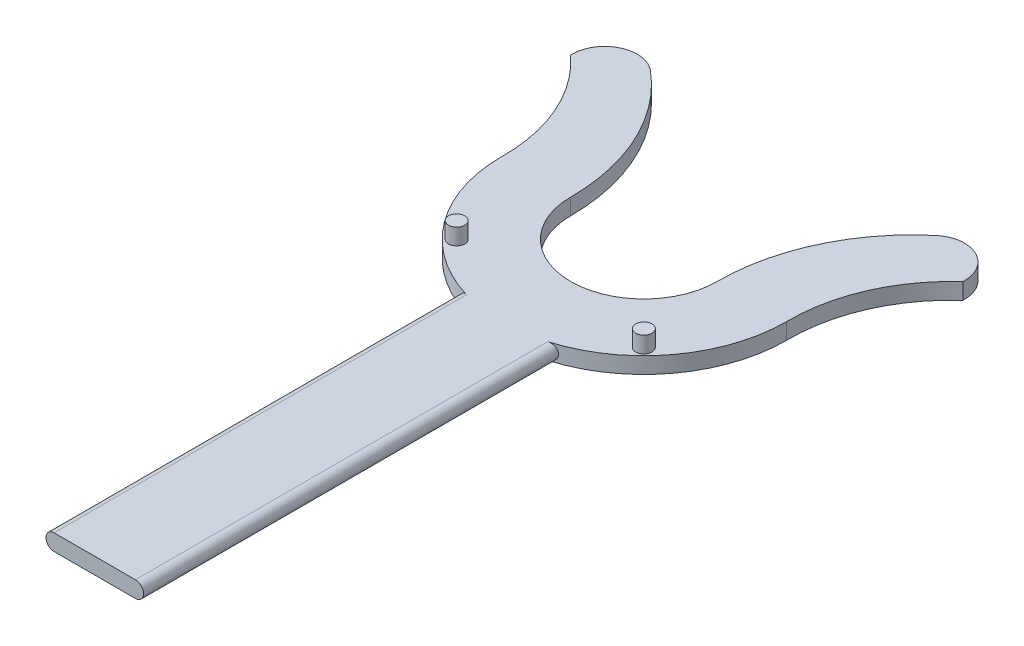
ISO-10303-21;
HEADER;
FILE_DESCRIPTION(('STEP AP214'),'2;1');
FILE_NAME('part.step','',(''),(''),'','','');
FILE_SCHEMA(('AUTOMOTIVE_DESIGN { 1 0 10303 214 1 1 1 1 }'));
ENDSEC;
DATA;
#1=APPLICATION_CONTEXT('core data for automotive mechanical design processes');
#2=APPLICATION_PROTOCOL_DEFINITION('international standard','automotive_design',2000,#1);
#3=PRODUCT_CONTEXT('',#1,'mechanical');
#4=PRODUCT('Part','Part','',(#3));
#5=PRODUCT_RELATED_PRODUCT_CATEGORY('part','',(#4));
#6=PRODUCT_DEFINITION_FORMATION('','',#4);
#7=PRODUCT_DEFINITION_CONTEXT('part definition',#1,'design');
#8=PRODUCT_DEFINITION('design','',#6,#7);
#9=PRODUCT_DEFINITION_SHAPE('','',#8);
#10=(LENGTH_UNIT() NAMED_UNIT(*) SI_UNIT(.MILLI.,.METRE.));
#11=(NAMED_UNIT(*) PLANE_ANGLE_UNIT() SI_UNIT($,.RADIAN.));
#12=(NAMED_UNIT(*) SI_UNIT($,.STERADIAN.) SOLID_ANGLE_UNIT());
#13=UNCERTAINTY_MEASURE_WITH_UNIT(LENGTH_MEASURE(1.E-05),#10,'distance_accuracy_value','');
#14=(GEOMETRIC_REPRESENTATION_CONTEXT(3) GLOBAL_UNCERTAINTY_ASSIGNED_CONTEXT((#13)) GLOBAL_UNIT_ASSIGNED_CONTEXT((#10,
#11,#12)) REPRESENTATION_CONTEXT('',''));
#15=CARTESIAN_POINT('',(0.,0.,0.));
#16=DIRECTION('',(0.,0.,1.));
#17=DIRECTION('',(1.,0.,0.));
#18=AXIS2_PLACEMENT_3D('',#15,#16,#17);
#19=CARTESIAN_POINT('',(0.,5.,0.));
#20=DIRECTION('',(0.,-1.,0.));
#21=DIRECTION('',(0.,0.,-1.));
#22=AXIS2_PLACEMENT_3D('',#19,#20,#21);
#23=CYLINDRICAL_SURFACE('',#22,43.8683028838698);
#24=CARTESIAN_POINT('',(12.5,0.,42.0497086542932));
#25=CARTESIAN_POINT('',(12.5733693515949,2.1894092655212E-06,42.0278995036626));
#26=CARTESIAN_POINT('',(12.6466441930321,0.00323151962138279,42.0059068862638));
#27=CARTESIAN_POINT('',(12.7925585434914,0.0160957391035275,41.9616996996989));
#28=CARTESIAN_POINT('',(12.8651980800744,0.0257303490870692,41.9394851402515));
#29=CARTESIAN_POINT('',(13.0814086548482,0.064152514706686,41.8727525246855));
#30=CARTESIAN_POINT('',(13.2233697795003,0.102458542840262,41.82811633173));
#31=CARTESIAN_POINT('',(13.4987413173805,0.203467171107175,41.740064037548));
#32=CARTESIAN_POINT('',(13.6321475451429,0.26618160852364,41.6966485392895));
#33=CARTESIAN_POINT('',(13.8865236638925,0.41452500541979,41.6126230130073));
#34=CARTESIAN_POINT('',(14.0074975932052,0.500146491339198,41.5720120754062));
#35=CARTESIAN_POINT('',(14.2317754698226,0.691033011919609,41.4957641681249));
#36=CARTESIAN_POINT('',(14.3352870231641,0.796030705080024,41.4600698477723));
#37=CARTESIAN_POINT('',(14.5229739584813,1.0237456859596,41.3946992651714));
#38=CARTESIAN_POINT('',(14.6071522013389,1.1464603475954,41.365022112598));
#39=CARTESIAN_POINT('',(14.7493972072204,1.39986321653058,41.3145098741825));
#40=CARTESIAN_POINT('',(14.8085251835027,1.52988397505562,41.2933181440597));
#41=CARTESIAN_POINT('',(14.9039564684172,1.79903353141504,41.2589708962229));
#42=CARTESIAN_POINT('',(14.9402700081378,1.93815821566115,41.2458117763762));
#43=CARTESIAN_POINT('',(14.9872002533355,2.21325545528377,41.2287813866802));
#44=CARTESIAN_POINT('',(14.999128335523,2.34897608145605,41.224436237671));
#45=CARTESIAN_POINT('',(15.0007788582729,2.62055989910838,41.2238357884518));
#46=CARTESIAN_POINT('',(14.9905050773595,2.75642306239677,41.2275791116687));
#47=CARTESIAN_POINT('',(14.9487221038857,3.02078124982947,41.2427468768057));
#48=CARTESIAN_POINT('',(14.917765489738,3.14937589964176,41.2539714261344));
#49=CARTESIAN_POINT('',(14.8363240804344,3.39937597180622,41.283330113974));
#50=CARTESIAN_POINT('',(14.7858380406375,3.52078093537961,41.3014646928709));
#51=CARTESIAN_POINT('',(14.6658817042171,3.7556632321135,41.3442139389347));
#52=CARTESIAN_POINT('',(14.5960562600073,3.8689367130128,41.3689494807169));
#53=CARTESIAN_POINT('',(14.4401192435805,4.08221345386868,41.4236377706855));
#54=CARTESIAN_POINT('',(14.3540050445154,4.18221456899047,41.4535913603122));
#55=CARTESIAN_POINT('',(14.1632364349689,4.37152375061304,41.5191689443877));
#56=CARTESIAN_POINT('',(14.0578650832822,4.460036212811,41.5550029785691));
#57=CARTESIAN_POINT('',(13.834781393847,4.61827181507706,41.629804914071));
#58=CARTESIAN_POINT('',(13.7170617658609,4.6879837678975,41.668774663473));
#59=CARTESIAN_POINT('',(13.4659303145624,4.8103045360802,41.7506294230548));
#60=CARTESIAN_POINT('',(13.3320186965021,4.86182020513545,41.7936125511146));
#61=CARTESIAN_POINT('',(13.0576571150991,4.94117898880422,41.8801408152021));
#62=CARTESIAN_POINT('',(12.9172164621306,4.96905478391254,41.9236850906051));
#63=CARTESIAN_POINT('',(12.7297500682714,4.9898480368896,41.980754843152));
#64=CARTESIAN_POINT('',(12.683867361115,4.9936555162944,41.9946403853101));
#65=CARTESIAN_POINT('',(12.5920032003091,4.99872822863854,42.0222767150252));
#66=CARTESIAN_POINT('',(12.5460220307346,4.99999760766291,42.036027685776));
#67=CARTESIAN_POINT('',(12.5,5.,42.0497086542932));
#68=B_SPLINE_CURVE_WITH_KNOTS('',3,(#24,#25,#26,#27,#28,#29,#30,#31,#32,#33,#34,#35,#36,#37,#38,
#39,#40,#41,#42,#43,#44,#45,#46,#47,#48,#49,#50,#51,#52,#53,#54,#55,#56,#57,#58,#59,#60,#61,#62,
#63,#64,#65,#66,#67),.UNSPECIFIED.,.F.,.F.,(4,2,2,2,2,2,2,2,2,2,2,2,2,2,2,2,2,2,2,2,2,4),(0.,
0.229482958190326,0.458955910996326,0.917598574365186,1.37646394219621,1.83517978466218,
2.28798467000116,2.7407225074762,3.1716834865059,3.60245106373712,4.00936953653413,
4.4162187615305,4.8126111650063,5.20902883535716,5.61327345008379,6.01758331202823,
6.44232204969376,6.86731297336693,7.31466963683109,7.76140684771889,7.90562492133867,
8.04960721606266),.UNSPECIFIED.);
#69=CARTESIAN_POINT('',(12.5,0.,42.0497086542932));
#70=VERTEX_POINT('',#69);
#71=CARTESIAN_POINT('',(12.5,5.,42.0497086542932));
#72=VERTEX_POINT('',#71);
#73=EDGE_CURVE('E137',#70,#72,#68,.T.);
#74=ORIENTED_EDGE('',*,*,#73,.F.);
#75=CARTESIAN_POINT('',(0.,0.,0.));
#76=DIRECTION('',(0.,1.,0.));
#77=DIRECTION('',(0.,0.,1.));
#78=AXIS2_PLACEMENT_3D('',#75,#76,#77);
#79=CIRCLE('',#78,43.8683028838698);
#80=CARTESIAN_POINT('',(43.8683028838698,0.,0.));
#81=VERTEX_POINT('',#80);
#82=EDGE_CURVE('E124',#70,#81,#79,.T.);
#83=ORIENTED_EDGE('',*,*,#82,.T.);
#84=DIRECTION('',(0.,-1.,0.));
#85=VECTOR('',#84,1.);
#86=CARTESIAN_POINT('',(43.8683028838698,5.,0.));
#87=LINE('',#86,#85);
#88=CARTESIAN_POINT('',(43.8683028838698,5.,0.));
#89=VERTEX_POINT('',#88);
#90=EDGE_CURVE('E187',#89,#81,#87,.T.);
#91=ORIENTED_EDGE('',*,*,#90,.F.);
#92=CARTESIAN_POINT('',(0.,5.,0.));
#93=DIRECTION('',(0.,1.,0.));
#94=DIRECTION('',(0.,0.,1.));
#95=AXIS2_PLACEMENT_3D('',#92,#93,#94);
#96=CIRCLE('',#95,43.8683028838698);
#97=EDGE_CURVE('E48',#72,#89,#96,.T.);
#98=ORIENTED_EDGE('',*,*,#97,.F.);
#99=EDGE_LOOP('',(#74,#83,#91,#98));
#100=FACE_BOUND('',#99,.T.);
#101=ADVANCED_FACE('F33',(#100),#23,.T.);
#102=CARTESIAN_POINT('',(-12.5,5.,42.0497086542932));
#103=CARTESIAN_POINT('',(-12.5733693515949,4.99999781059073,42.0278995036626));
#104=CARTESIAN_POINT('',(-12.6466441930321,4.99676848037861,42.0059068862638));
#105=CARTESIAN_POINT('',(-12.7925585434913,4.98390426089647,41.9616996996989));
#106=CARTESIAN_POINT('',(-12.8651980800744,4.97426965091293,41.9394851402515));
#107=CARTESIAN_POINT('',(-13.0814086548482,4.93584748529331,41.8727525246855));
#108=CARTESIAN_POINT('',(-13.2233697795002,4.89754145715974,41.82811633173));
#109=CARTESIAN_POINT('',(-13.4987413173805,4.79653282889282,41.740064037548));
#110=CARTESIAN_POINT('',(-13.6321475451429,4.73381839147636,41.6966485392895));
#111=CARTESIAN_POINT('',(-13.8865236638925,4.58547499458021,41.6126230130073));
#112=CARTESIAN_POINT('',(-14.0074975932052,4.4998535086608,41.5720120754062));
#113=CARTESIAN_POINT('',(-14.2317754698226,4.30896698808039,41.4957641681249));
#114=CARTESIAN_POINT('',(-14.3352870231641,4.20396929491997,41.4600698477723));
#115=CARTESIAN_POINT('',(-14.5229739584813,3.9762543140404,41.3946992651714));
#116=CARTESIAN_POINT('',(-14.6071522013389,3.85353965240461,41.365022112598));
#117=CARTESIAN_POINT('',(-14.7493972072204,3.60013678346942,41.3145098741825));
#118=CARTESIAN_POINT('',(-14.8085251835027,3.47011602494438,41.2933181440597));
#119=CARTESIAN_POINT('',(-14.9039564684172,3.20096646858496,41.2589708962229));
#120=CARTESIAN_POINT('',(-14.9402700081378,3.06184178433885,41.2458117763762));
#121=CARTESIAN_POINT('',(-14.9872002533355,2.78674454471622,41.2287813866802));
#122=CARTESIAN_POINT('',(-14.999128335523,2.65102391854395,41.224436237671));
#123=CARTESIAN_POINT('',(-15.0007788582729,2.37944010089162,41.2238357884518));
#124=CARTESIAN_POINT('',(-14.9905050773595,2.24357693760323,41.2275791116687));
#125=CARTESIAN_POINT('',(-14.9487221038857,1.97921875017053,41.2427468768057));
#126=CARTESIAN_POINT('',(-14.917765489738,1.85062410035824,41.2539714261344));
#127=CARTESIAN_POINT('',(-14.8363240804343,1.60062402819378,41.283330113974));
#128=CARTESIAN_POINT('',(-14.7858380406374,1.47921906462039,41.3014646928709));
#129=CARTESIAN_POINT('',(-14.6658817042171,1.2443367678865,41.3442139389347));
#130=CARTESIAN_POINT('',(-14.5960562600073,1.1310632869872,41.3689494807169));
#131=CARTESIAN_POINT('',(-14.4401192435805,0.917786546131322,41.4236377706855));
#132=CARTESIAN_POINT('',(-14.3540050445154,0.817785431009528,41.4535913603122));
#133=CARTESIAN_POINT('',(-14.1632364349689,0.628476249386957,41.5191689443877));
#134=CARTESIAN_POINT('',(-14.0578650832822,0.539963787189002,41.5550029785691));
#135=CARTESIAN_POINT('',(-13.834781393847,0.381728184922941,41.629804914071));
#136=CARTESIAN_POINT('',(-13.7170617658609,0.312016232102497,41.668774663473));
#137=CARTESIAN_POINT('',(-13.4659303145624,0.189695463919798,41.7506294230548));
#138=CARTESIAN_POINT('',(-13.3320186965021,0.138179794864546,41.7936125511146));
#139=CARTESIAN_POINT('',(-13.0576571150991,0.0588210111957823,41.8801408152021));
#140=CARTESIAN_POINT('',(-12.9172164621306,0.0309452160874551,41.9236850906051));
#141=CARTESIAN_POINT('',(-12.7297500682714,0.0101519631104003,41.980754843152));
#142=CARTESIAN_POINT('',(-12.683867361115,0.00634448370559475,41.9946403853101));
#143=CARTESIAN_POINT('',(-12.5920032003091,0.00127177136145741,42.0222767150252));
#144=CARTESIAN_POINT('',(-12.5460220307346,2.39233709071259E-06,42.036027685776));
#145=CARTESIAN_POINT('',(-12.5,0.,42.0497086542932));
#146=B_SPLINE_CURVE_WITH_KNOTS('',3,(#102,#103,#104,#105,#106,#107,#108,#109,#110,#111,#112,
#113,#114,#115,#116,#117,#118,#119,#120,#121,#122,#123,#124,#125,#126,#127,#128,#129,#130,#131,
#132,#133,#134,#135,#136,#137,#138,#139,#140,#141,#142,#143,#144,#145),.UNSPECIFIED.,.F.,.F.,(4,
2,2,2,2,2,2,2,2,2,2,2,2,2,2,2,2,2,2,2,2,4),(0.,0.229482958190325,0.458955910996326,
0.917598574365184,1.37646394219621,1.83517978466218,2.28798467000115,2.7407225074762,
3.1716834865059,3.60245106373712,4.00936953653413,4.41621876153049,4.8126111650063,
5.20902883535716,5.61327345008378,6.01758331202823,6.44232204969375,6.86731297336692,
7.31466963683108,7.76140684771889,7.90562492133867,8.04960721606266),.UNSPECIFIED.);
#147=CARTESIAN_POINT('',(-12.5,5.,42.0497086542932));
#148=VERTEX_POINT('',#147);
#149=CARTESIAN_POINT('',(-12.5,0.,42.0497086542932));
#150=VERTEX_POINT('',#149);
#151=EDGE_CURVE('E56',#148,#150,#146,.T.);
#152=ORIENTED_EDGE('',*,*,#151,.F.);
#153=CARTESIAN_POINT('',(-43.8683028838698,5.,0.));
#154=VERTEX_POINT('',#153);
#155=EDGE_CURVE('E185',#154,#148,#96,.T.);
#156=ORIENTED_EDGE('',*,*,#155,.F.);
#157=DIRECTION('',(0.,-1.,0.));
#158=VECTOR('',#157,1.);
#159=CARTESIAN_POINT('',(-43.8683028838698,5.,0.));
#160=LINE('',#159,#158);
#161=CARTESIAN_POINT('',(-43.8683028838698,0.,0.));
#162=VERTEX_POINT('',#161);
#163=EDGE_CURVE('E201',#154,#162,#160,.T.);
#164=ORIENTED_EDGE('',*,*,#163,.T.);
#165=EDGE_CURVE('E133',#162,#150,#79,.T.);
#166=ORIENTED_EDGE('',*,*,#165,.T.);
#167=EDGE_LOOP('',(#152,#156,#164,#166));
#168=FACE_BOUND('',#167,.T.);
#169=ADVANCED_FACE('F248',(#168),#23,.T.);
#170=CARTESIAN_POINT('',(46.9317323659522,5.,-0.347775713940884));
#171=DIRECTION('',(0.,1.,0.));
#172=DIRECTION('',(0.,0.,1.));
#173=AXIS2_PLACEMENT_3D('',#170,#171,#172);
#174=PLANE('',#173);
#175=CARTESIAN_POINT('',(28.7792459942923,5.,28.7792459942926));
#176=DIRECTION('',(0.,1.,0.));
#177=DIRECTION('',(0.,0.,1.));
#178=AXIS2_PLACEMENT_3D('',#175,#176,#177);
#179=CIRCLE('',#178,2.5);
#180=CARTESIAN_POINT('',(28.7792459942923,5.,31.2792459942926));
#181=VERTEX_POINT('',#180);
#182=EDGE_CURVE('E162',#181,#181,#179,.T.);
#183=ORIENTED_EDGE('',*,*,#182,.F.);
#184=EDGE_LOOP('',(#183));
#185=FACE_BOUND('',#184,.T.);
#186=CARTESIAN_POINT('',(93.8634647319043,5.,-0.695551427881767));
#187=DIRECTION('',(0.,-1.,0.));
#188=DIRECTION('',(0.,0.,1.));
#189=AXIS2_PLACEMENT_3D('',#186,#187,#188);
#190=CIRCLE('',#189,50.);
#191=CARTESIAN_POINT('',(60.3252134591881,5.,-37.779047778255));
#192=VERTEX_POINT('',#191);
#193=EDGE_CURVE('E170',#89,#192,#190,.T.);
#194=ORIENTED_EDGE('',*,*,#193,.T.);
#195=CARTESIAN_POINT('',(50.3379285391948,5.,-38.283170706592));
#196=DIRECTION('',(0.,1.,0.));
#197=DIRECTION('',(0.,0.,-1.));
#198=AXIS2_PLACEMENT_3D('',#195,#196,#197);
#199=CIRCLE('',#198,10.);
#200=CARTESIAN_POINT('',(43.9055142470338,5.,-45.9398048479103));
#201=VERTEX_POINT('',#200);
#202=EDGE_CURVE('E173',#192,#201,#199,.T.);
#203=ORIENTED_EDGE('',*,*,#202,.T.);
#204=CARTESIAN_POINT('',(82.5,5.,0.));
#205=DIRECTION('',(0.,1.,0.));
#206=DIRECTION('',(0.,0.,-1.));
#207=AXIS2_PLACEMENT_3D('',#204,#205,#206);
#208=CIRCLE('',#207,60.);
#209=CARTESIAN_POINT('',(22.5,5.,0.));
#210=VERTEX_POINT('',#209);
#211=EDGE_CURVE('E175',#201,#210,#208,.T.);
#212=ORIENTED_EDGE('',*,*,#211,.T.);
#213=CARTESIAN_POINT('',(0.,5.,0.));
#214=DIRECTION('',(0.,-1.,0.));
#215=DIRECTION('',(0.,0.,1.));
#216=AXIS2_PLACEMENT_3D('',#213,#214,#215);
#217=CIRCLE('',#216,22.5);
#218=CARTESIAN_POINT('',(-22.5,5.,0.));
#219=VERTEX_POINT('',#218);
#220=EDGE_CURVE('E177',#210,#219,#217,.T.);
#221=ORIENTED_EDGE('',*,*,#220,.T.);
#222=CARTESIAN_POINT('',(-82.5,5.,0.));
#223=DIRECTION('',(0.,1.,0.));
#224=DIRECTION('',(0.,0.,1.));
#225=AXIS2_PLACEMENT_3D('',#222,#223,#224);
#226=CIRCLE('',#225,60.);
#227=CARTESIAN_POINT('',(-43.9055142470338,5.,-45.9398048479104));
#228=VERTEX_POINT('',#227);
#229=EDGE_CURVE('E179',#219,#228,#226,.T.);
#230=ORIENTED_EDGE('',*,*,#229,.T.);
#231=CARTESIAN_POINT('',(-50.3379285391948,5.,-38.283170706592));
#232=DIRECTION('',(0.,1.,0.));
#233=DIRECTION('',(0.,0.,1.));
#234=AXIS2_PLACEMENT_3D('',#231,#232,#233);
#235=CIRCLE('',#234,10.);
#236=CARTESIAN_POINT('',(-60.3252134591881,5.,-37.7790477782551));
#237=VERTEX_POINT('',#236);
#238=EDGE_CURVE('E181',#228,#237,#235,.T.);
#239=ORIENTED_EDGE('',*,*,#238,.T.);
#240=CARTESIAN_POINT('',(-93.8634647319043,5.,-0.695551427881802));
#241=DIRECTION('',(0.,-1.,0.));
#242=DIRECTION('',(0.,0.,-1.));
#243=AXIS2_PLACEMENT_3D('',#240,#241,#242);
#244=CIRCLE('',#243,50.);
#245=EDGE_CURVE('E183',#237,#154,#244,.T.);
#246=ORIENTED_EDGE('',*,*,#245,.T.);
#247=ORIENTED_EDGE('',*,*,#155,.T.);
#248=DIRECTION('',(0.,0.,-1.));
#249=VECTOR('',#248,1.);
#250=CARTESIAN_POINT('',(-12.5,5.,168.86830288387));
#251=LINE('',#250,#249);
#252=CARTESIAN_POINT('',(-12.5,5.,168.86830288387));
#253=VERTEX_POINT('',#252);
#254=EDGE_CURVE('E148',#253,#148,#251,.T.);
#255=ORIENTED_EDGE('',*,*,#254,.F.);
#256=DIRECTION('',(-1.,0.,0.));
#257=VECTOR('',#256,1.);
#258=CARTESIAN_POINT('',(12.5,5.,168.86830288387));
#259=LINE('',#258,#257);
#260=CARTESIAN_POINT('',(12.5,5.,168.86830288387));
#261=VERTEX_POINT('',#260);
#262=EDGE_CURVE('E422',#261,#253,#259,.T.);
#263=ORIENTED_EDGE('',*,*,#262,.F.);
#264=DIRECTION('',(0.,0.,-1.));
#265=VECTOR('',#264,1.);
#266=CARTESIAN_POINT('',(12.5,5.,168.86830288387));
#267=LINE('',#266,#265);
#268=EDGE_CURVE('E156',#261,#72,#267,.T.);
#269=ORIENTED_EDGE('',*,*,#268,.T.);
#270=ORIENTED_EDGE('',*,*,#97,.T.);
#271=EDGE_LOOP('',(#194,#203,#212,#221,#230,#239,#246,#247,#255,#263,#269,#270));
#272=FACE_BOUND('',#271,.T.);
#273=CARTESIAN_POINT('',(-28.7792459942923,5.,28.7792459942926));
#274=DIRECTION('',(0.,1.,0.));
#275=DIRECTION('',(0.,0.,1.));
#276=AXIS2_PLACEMENT_3D('',#273,#274,#275);
#277=CIRCLE('',#276,2.49999999999998);
#278=CARTESIAN_POINT('',(-28.7792459942923,5.,31.2792459942926));
#279=VERTEX_POINT('',#278);
#280=EDGE_CURVE('E158',#279,#279,#277,.T.);
#281=ORIENTED_EDGE('',*,*,#280,.F.);
#282=EDGE_LOOP('',(#281));
#283=FACE_BOUND('',#282,.T.);
#284=ADVANCED_FACE('F236',(#185,#272,#283),#174,.T.);
#285=CARTESIAN_POINT('',(93.8634647319043,5.,-0.695551427881767));
#286=DIRECTION('',(0.,-1.,0.));
#287=DIRECTION('',(0.,0.,-1.));
#288=AXIS2_PLACEMENT_3D('',#285,#286,#287);
#289=CYLINDRICAL_SURFACE('',#288,50.);
#290=CARTESIAN_POINT('',(93.8634647319043,0.,-0.695551427881767));
#291=DIRECTION('',(0.,-1.,0.));
#292=DIRECTION('',(0.,0.,1.));
#293=AXIS2_PLACEMENT_3D('',#290,#291,#292);
#294=CIRCLE('',#293,50.);
#295=CARTESIAN_POINT('',(60.3252134591881,0.,-37.779047778255));
#296=VERTEX_POINT('',#295);
#297=EDGE_CURVE('E131',#81,#296,#294,.T.);
#298=ORIENTED_EDGE('',*,*,#297,.T.);
#299=DIRECTION('',(0.,-1.,0.));
#300=VECTOR('',#299,1.);
#301=CARTESIAN_POINT('',(60.3252134591881,5.,-37.779047778255));
#302=LINE('',#301,#300);
#303=EDGE_CURVE('E11',#192,#296,#302,.T.);
#304=ORIENTED_EDGE('',*,*,#303,.F.);
#305=ORIENTED_EDGE('',*,*,#193,.F.);
#306=ORIENTED_EDGE('',*,*,#90,.T.);
#307=EDGE_LOOP('',(#298,#304,#305,#306));
#308=FACE_BOUND('',#307,.T.);
#309=ADVANCED_FACE('F35',(#308),#289,.F.);
#310=CARTESIAN_POINT('',(50.3379285391948,5.,-38.283170706592));
#311=DIRECTION('',(0.,-1.,0.));
#312=DIRECTION('',(0.,0.,-1.));
#313=AXIS2_PLACEMENT_3D('',#310,#311,#312);
#314=CYLINDRICAL_SURFACE('',#313,10.);
#315=CARTESIAN_POINT('',(50.3379285391948,0.,-38.283170706592));
#316=DIRECTION('',(0.,1.,0.));
#317=DIRECTION('',(0.,0.,-1.));
#318=AXIS2_PLACEMENT_3D('',#315,#316,#317);
#319=CIRCLE('',#318,10.);
#320=CARTESIAN_POINT('',(43.9055142470338,0.,-45.9398048479103));
#321=VERTEX_POINT('',#320);
#322=EDGE_CURVE('E189',#296,#321,#319,.T.);
#323=ORIENTED_EDGE('',*,*,#322,.T.);
#324=DIRECTION('',(0.,-1.,0.));
#325=VECTOR('',#324,1.);
#326=CARTESIAN_POINT('',(43.9055142470338,5.,-45.9398048479103));
#327=LINE('',#326,#325);
#328=EDGE_CURVE('E41',#201,#321,#327,.T.);
#329=ORIENTED_EDGE('',*,*,#328,.F.);
#330=ORIENTED_EDGE('',*,*,#202,.F.);
#331=ORIENTED_EDGE('',*,*,#303,.T.);
#332=EDGE_LOOP('',(#323,#329,#330,#331));
#333=FACE_BOUND('',#332,.T.);
#334=ADVANCED_FACE('F241',(#333),#314,.T.);
#335=CARTESIAN_POINT('',(82.5,5.,0.));
#336=DIRECTION('',(0.,-1.,0.));
#337=DIRECTION('',(0.,0.,-1.));
#338=AXIS2_PLACEMENT_3D('',#335,#336,#337);
#339=CYLINDRICAL_SURFACE('',#338,60.);
#340=CARTESIAN_POINT('',(82.5,0.,0.));
#341=DIRECTION('',(0.,1.,0.));
#342=DIRECTION('',(0.,0.,-1.));
#343=AXIS2_PLACEMENT_3D('',#340,#341,#342);
#344=CIRCLE('',#343,60.);
#345=CARTESIAN_POINT('',(22.5,0.,0.));
#346=VERTEX_POINT('',#345);
#347=EDGE_CURVE('E191',#321,#346,#344,.T.);
#348=ORIENTED_EDGE('',*,*,#347,.T.);
#349=DIRECTION('',(0.,-1.,0.));
#350=VECTOR('',#349,1.);
#351=CARTESIAN_POINT('',(22.5,5.,0.));
#352=LINE('',#351,#350);
#353=EDGE_CURVE('E213',#210,#346,#352,.T.);
#354=ORIENTED_EDGE('',*,*,#353,.F.);
#355=ORIENTED_EDGE('',*,*,#211,.F.);
#356=ORIENTED_EDGE('',*,*,#328,.T.);
#357=EDGE_LOOP('',(#348,#354,#355,#356));
#358=FACE_BOUND('',#357,.T.);
#359=ADVANCED_FACE('F220',(#358),#339,.T.);
#360=CARTESIAN_POINT('',(0.,5.,0.));
#361=DIRECTION('',(0.,-1.,0.));
#362=DIRECTION('',(0.,0.,-1.));
#363=AXIS2_PLACEMENT_3D('',#360,#361,#362);
#364=CYLINDRICAL_SURFACE('',#363,22.5);
#365=CARTESIAN_POINT('',(0.,0.,0.));
#366=DIRECTION('',(0.,-1.,0.));
#367=DIRECTION('',(0.,0.,1.));
#368=AXIS2_PLACEMENT_3D('',#365,#366,#367);
#369=CIRCLE('',#368,22.5);
#370=CARTESIAN_POINT('',(-22.5,0.,0.));
#371=VERTEX_POINT('',#370);
#372=EDGE_CURVE('E193',#346,#371,#369,.T.);
#373=ORIENTED_EDGE('',*,*,#372,.T.);
#374=DIRECTION('',(0.,-1.,0.));
#375=VECTOR('',#374,1.);
#376=CARTESIAN_POINT('',(-22.5,5.,0.));
#377=LINE('',#376,#375);
#378=EDGE_CURVE('E210',#219,#371,#377,.T.);
#379=ORIENTED_EDGE('',*,*,#378,.F.);
#380=ORIENTED_EDGE('',*,*,#220,.F.);
#381=ORIENTED_EDGE('',*,*,#353,.T.);
#382=EDGE_LOOP('',(#373,#379,#380,#381));
#383=FACE_BOUND('',#382,.T.);
#384=ADVANCED_FACE('F228',(#383),#364,.F.);
#385=CARTESIAN_POINT('',(-82.5,5.,0.));
#386=DIRECTION('',(0.,-1.,0.));
#387=DIRECTION('',(0.,0.,-1.));
#388=AXIS2_PLACEMENT_3D('',#385,#386,#387);
#389=CYLINDRICAL_SURFACE('',#388,60.);
#390=CARTESIAN_POINT('',(-82.5,0.,0.));
#391=DIRECTION('',(0.,1.,0.));
#392=DIRECTION('',(0.,0.,1.));
#393=AXIS2_PLACEMENT_3D('',#390,#391,#392);
#394=CIRCLE('',#393,60.);
#395=CARTESIAN_POINT('',(-43.9055142470338,0.,-45.9398048479104));
#396=VERTEX_POINT('',#395);
#397=EDGE_CURVE('E195',#371,#396,#394,.T.);
#398=ORIENTED_EDGE('',*,*,#397,.T.);
#399=DIRECTION('',(0.,-1.,0.));
#400=VECTOR('',#399,1.);
#401=CARTESIAN_POINT('',(-43.9055142470338,5.,-45.9398048479104));
#402=LINE('',#401,#400);
#403=EDGE_CURVE('E207',#228,#396,#402,.T.);
#404=ORIENTED_EDGE('',*,*,#403,.F.);
#405=ORIENTED_EDGE('',*,*,#229,.F.);
#406=ORIENTED_EDGE('',*,*,#378,.T.);
#407=EDGE_LOOP('',(#398,#404,#405,#406));
#408=FACE_BOUND('',#407,.T.);
#409=ADVANCED_FACE('F232',(#408),#389,.T.);
#410=CARTESIAN_POINT('',(-50.3379285391948,5.,-38.283170706592));
#411=DIRECTION('',(0.,-1.,0.));
#412=DIRECTION('',(0.,0.,-1.));
#413=AXIS2_PLACEMENT_3D('',#410,#411,#412);
#414=CYLINDRICAL_SURFACE('',#413,10.);
#415=CARTESIAN_POINT('',(-50.3379285391948,0.,-38.283170706592));
#416=DIRECTION('',(0.,1.,0.));
#417=DIRECTION('',(0.,0.,1.));
#418=AXIS2_PLACEMENT_3D('',#415,#416,#417);
#419=CIRCLE('',#418,10.);
#420=CARTESIAN_POINT('',(-60.3252134591881,0.,-37.7790477782551));
#421=VERTEX_POINT('',#420);
#422=EDGE_CURVE('E197',#396,#421,#419,.T.);
#423=ORIENTED_EDGE('',*,*,#422,.T.);
#424=DIRECTION('',(0.,-1.,0.));
#425=VECTOR('',#424,1.);
#426=CARTESIAN_POINT('',(-60.3252134591881,5.,-37.7790477782551));
#427=LINE('',#426,#425);
#428=EDGE_CURVE('E204',#237,#421,#427,.T.);
#429=ORIENTED_EDGE('',*,*,#428,.F.);
#430=ORIENTED_EDGE('',*,*,#238,.F.);
#431=ORIENTED_EDGE('',*,*,#403,.T.);
#432=EDGE_LOOP('',(#423,#429,#430,#431));
#433=FACE_BOUND('',#432,.T.);
#434=ADVANCED_FACE('F261',(#433),#414,.T.);
#435=CARTESIAN_POINT('',(-93.8634647319043,5.,-0.695551427881802));
#436=DIRECTION('',(0.,-1.,0.));
#437=DIRECTION('',(0.,0.,-1.));
#438=AXIS2_PLACEMENT_3D('',#435,#436,#437);
#439=CYLINDRICAL_SURFACE('',#438,50.);
#440=CARTESIAN_POINT('',(-93.8634647319043,0.,-0.695551427881802));
#441=DIRECTION('',(0.,-1.,0.));
#442=DIRECTION('',(0.,0.,-1.));
#443=AXIS2_PLACEMENT_3D('',#440,#441,#442);
#444=CIRCLE('',#443,50.);
#445=EDGE_CURVE('E134',#421,#162,#444,.T.);
#446=ORIENTED_EDGE('',*,*,#445,.T.);
#447=ORIENTED_EDGE('',*,*,#163,.F.);
#448=ORIENTED_EDGE('',*,*,#245,.F.);
#449=ORIENTED_EDGE('',*,*,#428,.T.);
#450=EDGE_LOOP('',(#446,#447,#448,#449));
#451=FACE_BOUND('',#450,.T.);
#452=ADVANCED_FACE('F258',(#451),#439,.F.);
#453=CARTESIAN_POINT('',(46.9317323659522,0.,-0.347775713940884));
#454=DIRECTION('',(0.,1.,0.));
#455=DIRECTION('',(0.,0.,1.));
#456=AXIS2_PLACEMENT_3D('',#453,#454,#455);
#457=PLANE('',#456);
#458=ORIENTED_EDGE('',*,*,#297,.F.);
#459=ORIENTED_EDGE('',*,*,#82,.F.);
#460=DIRECTION('',(0.,0.,-1.));
#461=VECTOR('',#460,1.);
#462=CARTESIAN_POINT('',(12.5,0.,168.86830288387));
#463=LINE('',#462,#461);
#464=CARTESIAN_POINT('',(12.5,0.,168.86830288387));
#465=VERTEX_POINT('',#464);
#466=EDGE_CURVE('E128',#465,#70,#463,.T.);
#467=ORIENTED_EDGE('',*,*,#466,.F.);
#468=DIRECTION('',(1.,0.,0.));
#469=VECTOR('',#468,1.);
#470=CARTESIAN_POINT('',(12.5,0.,168.86830288387));
#471=LINE('',#470,#469);
#472=CARTESIAN_POINT('',(-12.5,0.,168.86830288387));
#473=VERTEX_POINT('',#472);
#474=EDGE_CURVE('E145',#473,#465,#471,.T.);
#475=ORIENTED_EDGE('',*,*,#474,.F.);
#476=DIRECTION('',(0.,0.,-1.));
#477=VECTOR('',#476,1.);
#478=CARTESIAN_POINT('',(-12.5,0.,168.86830288387));
#479=LINE('',#478,#477);
#480=EDGE_CURVE('E144',#473,#150,#479,.T.);
#481=ORIENTED_EDGE('',*,*,#480,.T.);
#482=ORIENTED_EDGE('',*,*,#165,.F.);
#483=ORIENTED_EDGE('',*,*,#445,.F.);
#484=ORIENTED_EDGE('',*,*,#422,.F.);
#485=ORIENTED_EDGE('',*,*,#397,.F.);
#486=ORIENTED_EDGE('',*,*,#372,.F.);
#487=ORIENTED_EDGE('',*,*,#347,.F.);
#488=ORIENTED_EDGE('',*,*,#322,.F.);
#489=EDGE_LOOP('',(#458,#459,#467,#475,#481,#482,#483,#484,#485,#486,#487,#488));
#490=FACE_BOUND('',#489,.T.);
#491=ADVANCED_FACE('F125',(#490),#457,.F.);
#492=CARTESIAN_POINT('',(28.7792459942923,10.,28.7792459942926));
#493=DIRECTION('',(0.,-1.,0.));
#494=DIRECTION('',(0.,0.,-1.));
#495=AXIS2_PLACEMENT_3D('',#492,#493,#494);
#496=CYLINDRICAL_SURFACE('',#495,2.5);
#497=CARTESIAN_POINT('',(28.7792459942923,10.,28.7792459942926));
#498=DIRECTION('',(0.,1.,0.));
#499=DIRECTION('',(0.,0.,1.));
#500=AXIS2_PLACEMENT_3D('',#497,#498,#499);
#501=CIRCLE('',#500,2.5);
#502=CARTESIAN_POINT('',(28.7792459942923,10.,31.2792459942926));
#503=VERTEX_POINT('',#502);
#504=EDGE_CURVE('E165',#503,#503,#501,.T.);
#505=ORIENTED_EDGE('',*,*,#504,.F.);
#506=EDGE_LOOP('',(#505));
#507=FACE_BOUND('',#506,.T.);
#508=ORIENTED_EDGE('',*,*,#182,.T.);
#509=EDGE_LOOP('',(#508));
#510=FACE_BOUND('',#509,.T.);
#511=ADVANCED_FACE('F298',(#507,#510),#496,.T.);
#512=CARTESIAN_POINT('',(28.7792459942923,10.,28.7792459942926));
#513=DIRECTION('',(0.,1.,0.));
#514=DIRECTION('',(0.,0.,1.));
#515=AXIS2_PLACEMENT_3D('',#512,#513,#514);
#516=PLANE('',#515);
#517=ORIENTED_EDGE('',*,*,#504,.T.);
#518=EDGE_LOOP('',(#517));
#519=FACE_BOUND('',#518,.T.);
#520=ADVANCED_FACE('F305',(#519),#516,.T.);
#521=CARTESIAN_POINT('',(-28.7792459942923,10.,28.7792459942926));
#522=DIRECTION('',(0.,-1.,0.));
#523=DIRECTION('',(0.,0.,-1.));
#524=AXIS2_PLACEMENT_3D('',#521,#522,#523);
#525=CYLINDRICAL_SURFACE('',#524,2.49999999999998);
#526=CARTESIAN_POINT('',(-28.7792459942923,10.,28.7792459942926));
#527=DIRECTION('',(0.,1.,0.));
#528=DIRECTION('',(0.,0.,1.));
#529=AXIS2_PLACEMENT_3D('',#526,#527,#528);
#530=CIRCLE('',#529,2.49999999999998);
#531=CARTESIAN_POINT('',(-28.7792459942923,10.,31.2792459942926));
#532=VERTEX_POINT('',#531);
#533=EDGE_CURVE('E159',#532,#532,#530,.T.);
#534=ORIENTED_EDGE('',*,*,#533,.F.);
#535=EDGE_LOOP('',(#534));
#536=FACE_BOUND('',#535,.T.);
#537=ORIENTED_EDGE('',*,*,#280,.T.);
#538=EDGE_LOOP('',(#537));
#539=FACE_BOUND('',#538,.T.);
#540=ADVANCED_FACE('F313',(#536,#539),#525,.T.);
#541=CARTESIAN_POINT('',(-28.7792459942923,10.,28.7792459942926));
#542=DIRECTION('',(0.,1.,0.));
#543=DIRECTION('',(0.,0.,1.));
#544=AXIS2_PLACEMENT_3D('',#541,#542,#543);
#545=PLANE('',#544);
#546=ORIENTED_EDGE('',*,*,#533,.T.);
#547=EDGE_LOOP('',(#546));
#548=FACE_BOUND('',#547,.T.);
#549=ADVANCED_FACE('F321',(#548),#545,.T.);
#550=CARTESIAN_POINT('',(12.5,2.5,168.86830288387));
#551=DIRECTION('',(0.,0.,-1.));
#552=DIRECTION('',(-1.,0.,0.));
#553=AXIS2_PLACEMENT_3D('',#550,#551,#552);
#554=CYLINDRICAL_SURFACE('',#553,2.5);
#555=ORIENTED_EDGE('',*,*,#466,.T.);
#556=ORIENTED_EDGE('',*,*,#73,.T.);
#557=ORIENTED_EDGE('',*,*,#268,.F.);
#558=CARTESIAN_POINT('',(12.5,2.5,168.86830288387));
#559=DIRECTION('',(0.,0.,1.));
#560=DIRECTION('',(1.,0.,0.));
#561=AXIS2_PLACEMENT_3D('',#558,#559,#560);
#562=CIRCLE('',#561,2.5);
#563=EDGE_CURVE('E140',#465,#261,#562,.T.);
#564=ORIENTED_EDGE('',*,*,#563,.F.);
#565=EDGE_LOOP('',(#555,#556,#557,#564));
#566=FACE_BOUND('',#565,.T.);
#567=ADVANCED_FACE('F142',(#566),#554,.T.);
#568=CARTESIAN_POINT('',(-12.5,2.5,168.86830288387));
#569=DIRECTION('',(0.,0.,-1.));
#570=DIRECTION('',(-1.,0.,0.));
#571=AXIS2_PLACEMENT_3D('',#568,#569,#570);
#572=CYLINDRICAL_SURFACE('',#571,2.5);
#573=ORIENTED_EDGE('',*,*,#254,.T.);
#574=ORIENTED_EDGE('',*,*,#151,.T.);
#575=ORIENTED_EDGE('',*,*,#480,.F.);
#576=CARTESIAN_POINT('',(-12.5,2.5,168.86830288387));
#577=DIRECTION('',(0.,0.,1.));
#578=DIRECTION('',(1.,0.,0.));
#579=AXIS2_PLACEMENT_3D('',#576,#577,#578);
#580=CIRCLE('',#579,2.5);
#581=EDGE_CURVE('E150',#253,#473,#580,.T.);
#582=ORIENTED_EDGE('',*,*,#581,.F.);
#583=EDGE_LOOP('',(#573,#574,#575,#582));
#584=FACE_BOUND('',#583,.T.);
#585=ADVANCED_FACE('F335',(#584),#572,.T.);
#586=CARTESIAN_POINT('',(12.5,2.5,168.86830288387));
#587=DIRECTION('',(0.,0.,1.));
#588=DIRECTION('',(1.,0.,0.));
#589=AXIS2_PLACEMENT_3D('',#586,#587,#588);
#590=PLANE('',#589);
#591=ORIENTED_EDGE('',*,*,#563,.T.);
#592=ORIENTED_EDGE('',*,*,#262,.T.);
#593=ORIENTED_EDGE('',*,*,#581,.T.);
#594=ORIENTED_EDGE('',*,*,#474,.T.);
#595=EDGE_LOOP('',(#591,#592,#593,#594));
#596=FACE_BOUND('',#595,.T.);
#597=ADVANCED_FACE('F342',(#596),#590,.T.);
#598=CLOSED_SHELL('',(#101,#169,#284,#309,#334,#359,#384,#409,#434,#452,#491,#511,#520,#540,
#549,#567,#585,#597));
#599=MANIFOLD_SOLID_BREP('B2',#598);
#600=ADVANCED_BREP_SHAPE_REPRESENTATION('',(#18,#599),#14);
#601=SHAPE_DEFINITION_REPRESENTATION(#9,#600);
ENDSEC;
END-ISO-10303-21;
